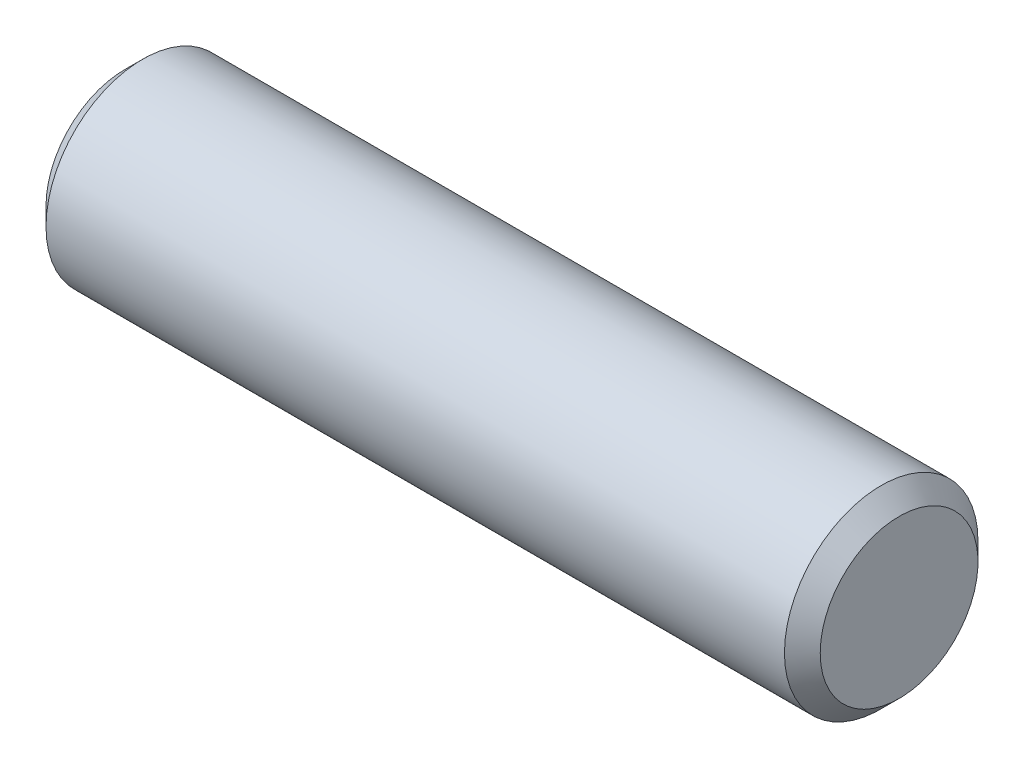
ISO-10303-21;
HEADER;
FILE_DESCRIPTION(('STEP AP214'),'2;1');
FILE_NAME('part.step','',(''),(''),'','','');
FILE_SCHEMA(('AUTOMOTIVE_DESIGN { 1 0 10303 214 1 1 1 1 }'));
ENDSEC;
DATA;
#1=APPLICATION_CONTEXT('core data for automotive mechanical design processes');
#2=APPLICATION_PROTOCOL_DEFINITION('international standard','automotive_design',2000,#1);
#3=PRODUCT_CONTEXT('',#1,'mechanical');
#4=PRODUCT('Part','Part','',(#3));
#5=PRODUCT_RELATED_PRODUCT_CATEGORY('part','',(#4));
#6=PRODUCT_DEFINITION_FORMATION('','',#4);
#7=PRODUCT_DEFINITION_CONTEXT('part definition',#1,'design');
#8=PRODUCT_DEFINITION('design','',#6,#7);
#9=PRODUCT_DEFINITION_SHAPE('','',#8);
#10=(LENGTH_UNIT() NAMED_UNIT(*) SI_UNIT(.MILLI.,.METRE.));
#11=(NAMED_UNIT(*) PLANE_ANGLE_UNIT() SI_UNIT($,.RADIAN.));
#12=(NAMED_UNIT(*) SI_UNIT($,.STERADIAN.) SOLID_ANGLE_UNIT());
#13=UNCERTAINTY_MEASURE_WITH_UNIT(LENGTH_MEASURE(1.E-05),#10,'distance_accuracy_value','');
#14=(GEOMETRIC_REPRESENTATION_CONTEXT(3) GLOBAL_UNCERTAINTY_ASSIGNED_CONTEXT((#13)) GLOBAL_UNIT_ASSIGNED_CONTEXT((#10,
#11,#12)) REPRESENTATION_CONTEXT('',''));
#15=CARTESIAN_POINT('',(0.,0.,0.));
#16=DIRECTION('',(0.,0.,1.));
#17=DIRECTION('',(1.,0.,0.));
#18=AXIS2_PLACEMENT_3D('',#15,#16,#17);
#19=CARTESIAN_POINT('',(-12.,0.,0.));
#20=DIRECTION('',(1.,0.,0.));
#21=DIRECTION('',(0.,0.,-1.));
#22=AXIS2_PLACEMENT_3D('',#19,#20,#21);
#23=CONICAL_SURFACE('',#22,2.4455,0.785398163397468);
#24=CARTESIAN_POINT('',(-11.4455,0.,0.));
#25=DIRECTION('',(-1.,0.,0.));
#26=DIRECTION('',(0.,0.,1.));
#27=AXIS2_PLACEMENT_3D('',#24,#25,#26);
#28=CIRCLE('',#27,3.);
#29=CARTESIAN_POINT('',(-11.4455,0.,3.));
#30=VERTEX_POINT('',#29);
#31=EDGE_CURVE('E51',#30,#30,#28,.T.);
#32=ORIENTED_EDGE('',*,*,#31,.T.);
#33=EDGE_LOOP('',(#32));
#34=FACE_BOUND('',#33,.T.);
#35=CARTESIAN_POINT('',(-12.,0.,0.));
#36=DIRECTION('',(-1.,0.,0.));
#37=DIRECTION('',(0.,0.,1.));
#38=AXIS2_PLACEMENT_3D('',#35,#36,#37);
#39=CIRCLE('',#38,2.4455);
#40=CARTESIAN_POINT('',(-12.,0.,2.4455));
#41=VERTEX_POINT('',#40);
#42=EDGE_CURVE('E10',#41,#41,#39,.T.);
#43=ORIENTED_EDGE('',*,*,#42,.F.);
#44=EDGE_LOOP('',(#43));
#45=FACE_BOUND('',#44,.T.);
#46=ADVANCED_FACE('F34',(#34,#45),#23,.T.);
#47=CARTESIAN_POINT('',(-12.,2.4455,0.));
#48=DIRECTION('',(1.,0.,0.));
#49=DIRECTION('',(0.,0.,-1.));
#50=AXIS2_PLACEMENT_3D('',#47,#48,#49);
#51=PLANE('',#50);
#52=ORIENTED_EDGE('',*,*,#42,.T.);
#53=EDGE_LOOP('',(#52));
#54=FACE_BOUND('',#53,.T.);
#55=ADVANCED_FACE('F70',(#54),#51,.F.);
#56=CARTESIAN_POINT('',(12.,2.4455,0.));
#57=DIRECTION('',(1.,0.,0.));
#58=DIRECTION('',(0.,0.,-1.));
#59=AXIS2_PLACEMENT_3D('',#56,#57,#58);
#60=PLANE('',#59);
#61=CARTESIAN_POINT('',(12.,0.,0.));
#62=DIRECTION('',(-1.,0.,0.));
#63=DIRECTION('',(0.,0.,1.));
#64=AXIS2_PLACEMENT_3D('',#61,#62,#63);
#65=CIRCLE('',#64,2.4455);
#66=CARTESIAN_POINT('',(12.,0.,2.4455));
#67=VERTEX_POINT('',#66);
#68=EDGE_CURVE('E40',#67,#67,#65,.T.);
#69=ORIENTED_EDGE('',*,*,#68,.F.);
#70=EDGE_LOOP('',(#69));
#71=FACE_BOUND('',#70,.T.);
#72=ADVANCED_FACE('F66',(#71),#60,.T.);
#73=CARTESIAN_POINT('',(12.,0.,0.));
#74=DIRECTION('',(-1.,0.,0.));
#75=DIRECTION('',(0.,0.,1.));
#76=AXIS2_PLACEMENT_3D('',#73,#74,#75);
#77=CONICAL_SURFACE('',#76,2.4455,0.785398163397468);
#78=CARTESIAN_POINT('',(11.4455,0.,0.));
#79=DIRECTION('',(-1.,0.,0.));
#80=DIRECTION('',(0.,0.,1.));
#81=AXIS2_PLACEMENT_3D('',#78,#79,#80);
#82=CIRCLE('',#81,3.);
#83=CARTESIAN_POINT('',(11.4455,0.,3.));
#84=VERTEX_POINT('',#83);
#85=EDGE_CURVE('E45',#84,#84,#82,.T.);
#86=ORIENTED_EDGE('',*,*,#85,.F.);
#87=EDGE_LOOP('',(#86));
#88=FACE_BOUND('',#87,.T.);
#89=ORIENTED_EDGE('',*,*,#68,.T.);
#90=EDGE_LOOP('',(#89));
#91=FACE_BOUND('',#90,.T.);
#92=ADVANCED_FACE('F61',(#88,#91),#77,.T.);
#93=CARTESIAN_POINT('',(0.,0.,0.));
#94=DIRECTION('',(-1.,0.,0.));
#95=DIRECTION('',(0.,0.,1.));
#96=AXIS2_PLACEMENT_3D('',#93,#94,#95);
#97=CYLINDRICAL_SURFACE('',#96,3.);
#98=ORIENTED_EDGE('',*,*,#85,.T.);
#99=EDGE_LOOP('',(#98));
#100=FACE_BOUND('',#99,.T.);
#101=ORIENTED_EDGE('',*,*,#31,.F.);
#102=EDGE_LOOP('',(#101));
#103=FACE_BOUND('',#102,.T.);
#104=ADVANCED_FACE('F59',(#100,#103),#97,.T.);
#105=CLOSED_SHELL('',(#46,#55,#72,#92,#104));
#106=MANIFOLD_SOLID_BREP('B2',#105);
#107=ADVANCED_BREP_SHAPE_REPRESENTATION('',(#18,#106),#14);
#108=SHAPE_DEFINITION_REPRESENTATION(#9,#107);
ENDSEC;
END-ISO-10303-21;
